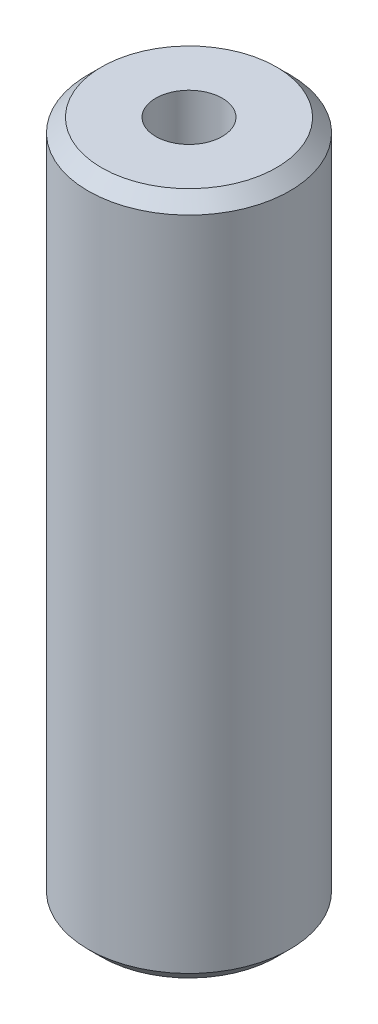
ISO-10303-21;
HEADER;
FILE_DESCRIPTION(('STEP AP214'),'2;1');
FILE_NAME('part.step','',(''),(''),'','','');
FILE_SCHEMA(('AUTOMOTIVE_DESIGN { 1 0 10303 214 1 1 1 1 }'));
ENDSEC;
DATA;
#1=APPLICATION_CONTEXT('core data for automotive mechanical design processes');
#2=APPLICATION_PROTOCOL_DEFINITION('international standard','automotive_design',2000,#1);
#3=PRODUCT_CONTEXT('',#1,'mechanical');
#4=PRODUCT('Part','Part','',(#3));
#5=PRODUCT_RELATED_PRODUCT_CATEGORY('part','',(#4));
#6=PRODUCT_DEFINITION_FORMATION('','',#4);
#7=PRODUCT_DEFINITION_CONTEXT('part definition',#1,'design');
#8=PRODUCT_DEFINITION('design','',#6,#7);
#9=PRODUCT_DEFINITION_SHAPE('','',#8);
#10=(LENGTH_UNIT() NAMED_UNIT(*) SI_UNIT(.MILLI.,.METRE.));
#11=(NAMED_UNIT(*) PLANE_ANGLE_UNIT() SI_UNIT($,.RADIAN.));
#12=(NAMED_UNIT(*) SI_UNIT($,.STERADIAN.) SOLID_ANGLE_UNIT());
#13=UNCERTAINTY_MEASURE_WITH_UNIT(LENGTH_MEASURE(1.E-05),#10,'distance_accuracy_value','');
#14=(GEOMETRIC_REPRESENTATION_CONTEXT(3) GLOBAL_UNCERTAINTY_ASSIGNED_CONTEXT((#13)) GLOBAL_UNIT_ASSIGNED_CONTEXT((#10,
#11,#12)) REPRESENTATION_CONTEXT('',''));
#15=CARTESIAN_POINT('',(0.,0.,0.));
#16=DIRECTION('',(0.,0.,1.));
#17=DIRECTION('',(1.,0.,0.));
#18=AXIS2_PLACEMENT_3D('',#15,#16,#17);
#19=CARTESIAN_POINT('',(0.,67.8072210968488,0.));
#20=DIRECTION('',(0.,-1.,0.));
#21=DIRECTION('',(0.,0.,-1.));
#22=AXIS2_PLACEMENT_3D('',#19,#20,#21);
#23=CYLINDRICAL_SURFACE('',#22,10.);
#24=CARTESIAN_POINT('',(0.,66.4767580207448,0.));
#25=DIRECTION('',(0.,1.,0.));
#26=DIRECTION('',(0.,0.,1.));
#27=AXIS2_PLACEMENT_3D('',#24,#25,#26);
#28=CIRCLE('',#27,10.);
#29=CARTESIAN_POINT('',(0.,66.4767580207448,10.));
#30=VERTEX_POINT('',#29);
#31=EDGE_CURVE('E50',#30,#30,#28,.F.);
#32=ORIENTED_EDGE('',*,*,#31,.T.);
#33=EDGE_LOOP('',(#32));
#34=FACE_BOUND('',#33,.T.);
#35=CARTESIAN_POINT('',(0.,1.33046307610404,0.));
#36=DIRECTION('',(0.,1.,0.));
#37=DIRECTION('',(0.,0.,1.));
#38=AXIS2_PLACEMENT_3D('',#35,#36,#37);
#39=CIRCLE('',#38,10.);
#40=CARTESIAN_POINT('',(0.,1.33046307610404,10.));
#41=VERTEX_POINT('',#40);
#42=EDGE_CURVE('E51',#41,#41,#39,.T.);
#43=ORIENTED_EDGE('',*,*,#42,.T.);
#44=EDGE_LOOP('',(#43));
#45=FACE_BOUND('',#44,.T.);
#46=ADVANCED_FACE('F39',(#34,#45),#23,.T.);
#47=CARTESIAN_POINT('',(0.,67.8072210968488,0.));
#48=DIRECTION('',(0.,1.,0.));
#49=DIRECTION('',(0.,0.,1.));
#50=AXIS2_PLACEMENT_3D('',#47,#48,#49);
#51=PLANE('',#50);
#52=CARTESIAN_POINT('',(0.,67.8072210968488,0.));
#53=DIRECTION('',(0.,1.,0.));
#54=DIRECTION('',(0.,0.,1.));
#55=AXIS2_PLACEMENT_3D('',#52,#53,#54);
#56=CIRCLE('',#55,8.66953692389594);
#57=CARTESIAN_POINT('',(0.,67.8072210968488,8.66953692389594));
#58=VERTEX_POINT('',#57);
#59=EDGE_CURVE('E54',#58,#58,#56,.T.);
#60=ORIENTED_EDGE('',*,*,#59,.T.);
#61=EDGE_LOOP('',(#60));
#62=FACE_BOUND('',#61,.T.);
#63=CARTESIAN_POINT('',(0.,67.8072210968488,0.));
#64=DIRECTION('',(0.,1.,0.));
#65=DIRECTION('',(0.,0.,1.));
#66=AXIS2_PLACEMENT_3D('',#63,#64,#65);
#67=CIRCLE('',#66,3.29748759135515);
#68=CARTESIAN_POINT('',(0.,67.8072210968488,3.29748759135515));
#69=VERTEX_POINT('',#68);
#70=EDGE_CURVE('E58',#69,#69,#67,.T.);
#71=ORIENTED_EDGE('',*,*,#70,.F.);
#72=EDGE_LOOP('',(#71));
#73=FACE_BOUND('',#72,.T.);
#74=ADVANCED_FACE('F69',(#62,#73),#51,.T.);
#75=CARTESIAN_POINT('',(0.,0.,0.));
#76=DIRECTION('',(0.,1.,0.));
#77=DIRECTION('',(0.,0.,1.));
#78=AXIS2_PLACEMENT_3D('',#75,#76,#77);
#79=PLANE('',#78);
#80=CARTESIAN_POINT('',(0.,0.,0.));
#81=DIRECTION('',(0.,1.,0.));
#82=DIRECTION('',(0.,0.,1.));
#83=AXIS2_PLACEMENT_3D('',#80,#81,#82);
#84=CIRCLE('',#83,8.66953692389594);
#85=CARTESIAN_POINT('',(0.,0.,8.66953692389594));
#86=VERTEX_POINT('',#85);
#87=EDGE_CURVE('E10',#86,#86,#84,.F.);
#88=ORIENTED_EDGE('',*,*,#87,.T.);
#89=EDGE_LOOP('',(#88));
#90=FACE_BOUND('',#89,.T.);
#91=CARTESIAN_POINT('',(0.,0.,0.));
#92=DIRECTION('',(0.,1.,0.));
#93=DIRECTION('',(0.,0.,1.));
#94=AXIS2_PLACEMENT_3D('',#91,#92,#93);
#95=CIRCLE('',#94,3.29748759135515);
#96=CARTESIAN_POINT('',(0.,0.,3.29748759135515));
#97=VERTEX_POINT('',#96);
#98=EDGE_CURVE('E63',#97,#97,#95,.T.);
#99=ORIENTED_EDGE('',*,*,#98,.T.);
#100=EDGE_LOOP('',(#99));
#101=FACE_BOUND('',#100,.T.);
#102=ADVANCED_FACE('F75',(#90,#101),#79,.F.);
#103=CARTESIAN_POINT('',(0.,67.8072210968488,0.));
#104=DIRECTION('',(0.,-1.,0.));
#105=DIRECTION('',(0.,0.,-1.));
#106=AXIS2_PLACEMENT_3D('',#103,#104,#105);
#107=CYLINDRICAL_SURFACE('',#106,3.29748759135515);
#108=ORIENTED_EDGE('',*,*,#70,.T.);
#109=EDGE_LOOP('',(#108));
#110=FACE_BOUND('',#109,.T.);
#111=ORIENTED_EDGE('',*,*,#98,.F.);
#112=EDGE_LOOP('',(#111));
#113=FACE_BOUND('',#112,.T.);
#114=ADVANCED_FACE('F70',(#110,#113),#107,.F.);
#115=CARTESIAN_POINT('',(0.,67.8072210968488,0.));
#116=DIRECTION('',(0.,-1.,0.));
#117=DIRECTION('',(0.,0.,-1.));
#118=AXIS2_PLACEMENT_3D('',#115,#116,#117);
#119=CONICAL_SURFACE('',#118,8.66953692389594,0.785398163397445);
#120=ORIENTED_EDGE('',*,*,#31,.F.);
#121=EDGE_LOOP('',(#120));
#122=FACE_BOUND('',#121,.T.);
#123=ORIENTED_EDGE('',*,*,#59,.F.);
#124=EDGE_LOOP('',(#123));
#125=FACE_BOUND('',#124,.T.);
#126=ADVANCED_FACE('F81',(#122,#125),#119,.T.);
#127=CARTESIAN_POINT('',(0.,1.33046307610404,0.));
#128=DIRECTION('',(0.,1.,0.));
#129=DIRECTION('',(0.,0.,1.));
#130=AXIS2_PLACEMENT_3D('',#127,#128,#129);
#131=CONICAL_SURFACE('',#130,10.,0.785398163397453);
#132=ORIENTED_EDGE('',*,*,#87,.F.);
#133=EDGE_LOOP('',(#132));
#134=FACE_BOUND('',#133,.T.);
#135=ORIENTED_EDGE('',*,*,#42,.F.);
#136=EDGE_LOOP('',(#135));
#137=FACE_BOUND('',#136,.T.);
#138=ADVANCED_FACE('F45',(#134,#137),#131,.T.);
#139=CLOSED_SHELL('',(#46,#74,#102,#114,#126,#138));
#140=MANIFOLD_SOLID_BREP('B2',#139);
#141=ADVANCED_BREP_SHAPE_REPRESENTATION('',(#18,#140),#14);
#142=SHAPE_DEFINITION_REPRESENTATION(#9,#141);
ENDSEC;
END-ISO-10303-21;
